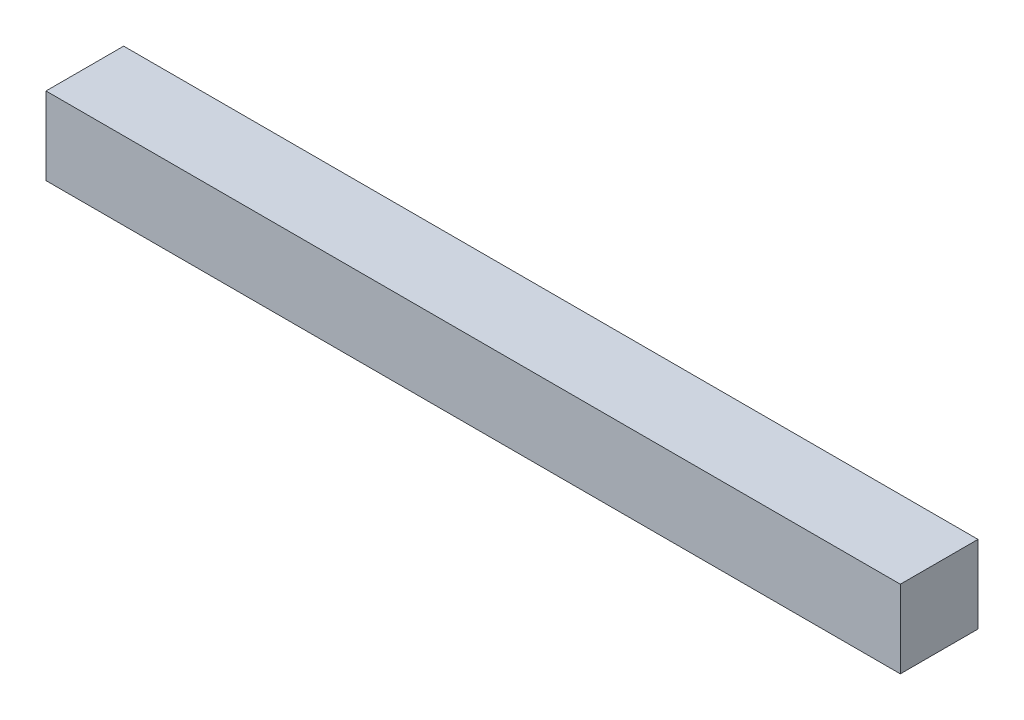
ISO-10303-21;
HEADER;
FILE_DESCRIPTION(('STEP AP214'),'2;1');
FILE_NAME('part.step','',(''),(''),'','','');
FILE_SCHEMA(('AUTOMOTIVE_DESIGN { 1 0 10303 214 1 1 1 1 }'));
ENDSEC;
DATA;
#1=APPLICATION_CONTEXT('core data for automotive mechanical design processes');
#2=APPLICATION_PROTOCOL_DEFINITION('international standard','automotive_design',2000,#1);
#3=PRODUCT_CONTEXT('',#1,'mechanical');
#4=PRODUCT('Part','Part','',(#3));
#5=PRODUCT_RELATED_PRODUCT_CATEGORY('part','',(#4));
#6=PRODUCT_DEFINITION_FORMATION('','',#4);
#7=PRODUCT_DEFINITION_CONTEXT('part definition',#1,'design');
#8=PRODUCT_DEFINITION('design','',#6,#7);
#9=PRODUCT_DEFINITION_SHAPE('','',#8);
#10=(LENGTH_UNIT() NAMED_UNIT(*) SI_UNIT(.MILLI.,.METRE.));
#11=(NAMED_UNIT(*) PLANE_ANGLE_UNIT() SI_UNIT($,.RADIAN.));
#12=(NAMED_UNIT(*) SI_UNIT($,.STERADIAN.) SOLID_ANGLE_UNIT());
#13=UNCERTAINTY_MEASURE_WITH_UNIT(LENGTH_MEASURE(1.E-05),#10,'distance_accuracy_value','');
#14=(GEOMETRIC_REPRESENTATION_CONTEXT(3) GLOBAL_UNCERTAINTY_ASSIGNED_CONTEXT((#13)) GLOBAL_UNIT_ASSIGNED_CONTEXT((#10,
#11,#12)) REPRESENTATION_CONTEXT('',''));
#15=CARTESIAN_POINT('',(0.,0.,0.));
#16=DIRECTION('',(0.,0.,1.));
#17=DIRECTION('',(1.,0.,0.));
#18=AXIS2_PLACEMENT_3D('',#15,#16,#17);
#19=CARTESIAN_POINT('',(165.,-15.,-15.));
#20=DIRECTION('',(0.,0.,1.));
#21=DIRECTION('',(1.,0.,0.));
#22=AXIS2_PLACEMENT_3D('',#19,#20,#21);
#23=PLANE('',#22);
#24=DIRECTION('',(0.,1.,0.));
#25=VECTOR('',#24,1.);
#26=CARTESIAN_POINT('',(-165.,-15.,-15.));
#27=LINE('',#26,#25);
#28=CARTESIAN_POINT('',(-165.,-15.,-15.));
#29=VERTEX_POINT('',#28);
#30=CARTESIAN_POINT('',(-165.,15.,-15.));
#31=VERTEX_POINT('',#30);
#32=EDGE_CURVE('E96',#29,#31,#27,.T.);
#33=ORIENTED_EDGE('',*,*,#32,.T.);
#34=DIRECTION('',(-1.,0.,0.));
#35=VECTOR('',#34,1.);
#36=CARTESIAN_POINT('',(165.,15.,-15.));
#37=LINE('',#36,#35);
#38=CARTESIAN_POINT('',(165.,15.,-15.));
#39=VERTEX_POINT('',#38);
#40=EDGE_CURVE('E11',#39,#31,#37,.T.);
#41=ORIENTED_EDGE('',*,*,#40,.F.);
#42=DIRECTION('',(0.,1.,0.));
#43=VECTOR('',#42,1.);
#44=CARTESIAN_POINT('',(165.,-15.,-15.));
#45=LINE('',#44,#43);
#46=CARTESIAN_POINT('',(165.,-15.,-15.));
#47=VERTEX_POINT('',#46);
#48=EDGE_CURVE('E84',#47,#39,#45,.T.);
#49=ORIENTED_EDGE('',*,*,#48,.F.);
#50=DIRECTION('',(-1.,0.,0.));
#51=VECTOR('',#50,1.);
#52=CARTESIAN_POINT('',(165.,-15.,-15.));
#53=LINE('',#52,#51);
#54=EDGE_CURVE('E92',#47,#29,#53,.T.);
#55=ORIENTED_EDGE('',*,*,#54,.T.);
#56=EDGE_LOOP('',(#33,#41,#49,#55));
#57=FACE_BOUND('',#56,.T.);
#58=ADVANCED_FACE('F33',(#57),#23,.F.);
#59=CARTESIAN_POINT('',(165.,15.,15.));
#60=DIRECTION('',(0.,-1.,0.));
#61=DIRECTION('',(0.,0.,-1.));
#62=AXIS2_PLACEMENT_3D('',#59,#60,#61);
#63=PLANE('',#62);
#64=DIRECTION('',(0.,0.,1.));
#65=VECTOR('',#64,1.);
#66=CARTESIAN_POINT('',(-165.,15.,15.));
#67=LINE('',#66,#65);
#68=CARTESIAN_POINT('',(-165.,15.,15.));
#69=VERTEX_POINT('',#68);
#70=EDGE_CURVE('E88',#31,#69,#67,.T.);
#71=ORIENTED_EDGE('',*,*,#70,.T.);
#72=DIRECTION('',(-1.,0.,0.));
#73=VECTOR('',#72,1.);
#74=CARTESIAN_POINT('',(165.,15.,15.));
#75=LINE('',#74,#73);
#76=CARTESIAN_POINT('',(165.,15.,15.));
#77=VERTEX_POINT('',#76);
#78=EDGE_CURVE('E41',#77,#69,#75,.T.);
#79=ORIENTED_EDGE('',*,*,#78,.F.);
#80=DIRECTION('',(0.,0.,1.));
#81=VECTOR('',#80,1.);
#82=CARTESIAN_POINT('',(165.,15.,15.));
#83=LINE('',#82,#81);
#84=EDGE_CURVE('E79',#39,#77,#83,.T.);
#85=ORIENTED_EDGE('',*,*,#84,.F.);
#86=ORIENTED_EDGE('',*,*,#40,.T.);
#87=EDGE_LOOP('',(#71,#79,#85,#86));
#88=FACE_BOUND('',#87,.T.);
#89=ADVANCED_FACE('F87',(#88),#63,.F.);
#90=CARTESIAN_POINT('',(165.,-15.,15.));
#91=DIRECTION('',(0.,0.,-1.));
#92=DIRECTION('',(-1.,0.,0.));
#93=AXIS2_PLACEMENT_3D('',#90,#91,#92);
#94=PLANE('',#93);
#95=DIRECTION('',(0.,-1.,0.));
#96=VECTOR('',#95,1.);
#97=CARTESIAN_POINT('',(-165.,-15.,15.));
#98=LINE('',#97,#96);
#99=CARTESIAN_POINT('',(-165.,-15.,15.));
#100=VERTEX_POINT('',#99);
#101=EDGE_CURVE('E66',#69,#100,#98,.T.);
#102=ORIENTED_EDGE('',*,*,#101,.T.);
#103=DIRECTION('',(-1.,0.,0.));
#104=VECTOR('',#103,1.);
#105=CARTESIAN_POINT('',(165.,-15.,15.));
#106=LINE('',#105,#104);
#107=CARTESIAN_POINT('',(165.,-15.,15.));
#108=VERTEX_POINT('',#107);
#109=EDGE_CURVE('E89',#108,#100,#106,.T.);
#110=ORIENTED_EDGE('',*,*,#109,.F.);
#111=DIRECTION('',(0.,-1.,0.));
#112=VECTOR('',#111,1.);
#113=CARTESIAN_POINT('',(165.,-15.,15.));
#114=LINE('',#113,#112);
#115=EDGE_CURVE('E82',#77,#108,#114,.T.);
#116=ORIENTED_EDGE('',*,*,#115,.F.);
#117=ORIENTED_EDGE('',*,*,#78,.T.);
#118=EDGE_LOOP('',(#102,#110,#116,#117));
#119=FACE_BOUND('',#118,.T.);
#120=ADVANCED_FACE('F90',(#119),#94,.F.);
#121=CARTESIAN_POINT('',(165.,-15.,15.));
#122=DIRECTION('',(0.,1.,0.));
#123=DIRECTION('',(0.,0.,1.));
#124=AXIS2_PLACEMENT_3D('',#121,#122,#123);
#125=PLANE('',#124);
#126=DIRECTION('',(0.,0.,-1.));
#127=VECTOR('',#126,1.);
#128=CARTESIAN_POINT('',(-165.,-15.,15.));
#129=LINE('',#128,#127);
#130=EDGE_CURVE('E72',#100,#29,#129,.T.);
#131=ORIENTED_EDGE('',*,*,#130,.T.);
#132=ORIENTED_EDGE('',*,*,#54,.F.);
#133=DIRECTION('',(0.,0.,-1.));
#134=VECTOR('',#133,1.);
#135=CARTESIAN_POINT('',(165.,-15.,15.));
#136=LINE('',#135,#134);
#137=EDGE_CURVE('E49',#108,#47,#136,.T.);
#138=ORIENTED_EDGE('',*,*,#137,.F.);
#139=ORIENTED_EDGE('',*,*,#109,.T.);
#140=EDGE_LOOP('',(#131,#132,#138,#139));
#141=FACE_BOUND('',#140,.T.);
#142=ADVANCED_FACE('F103',(#141),#125,.F.);
#143=CARTESIAN_POINT('',(165.,0.,0.));
#144=DIRECTION('',(-1.,0.,0.));
#145=DIRECTION('',(0.,0.,1.));
#146=AXIS2_PLACEMENT_3D('',#143,#144,#145);
#147=PLANE('',#146);
#148=ORIENTED_EDGE('',*,*,#48,.T.);
#149=ORIENTED_EDGE('',*,*,#84,.T.);
#150=ORIENTED_EDGE('',*,*,#115,.T.);
#151=ORIENTED_EDGE('',*,*,#137,.T.);
#152=EDGE_LOOP('',(#148,#149,#150,#151));
#153=FACE_BOUND('',#152,.T.);
#154=ADVANCED_FACE('F80',(#153),#147,.F.);
#155=CARTESIAN_POINT('',(-165.,0.,0.));
#156=DIRECTION('',(-1.,0.,0.));
#157=DIRECTION('',(0.,0.,1.));
#158=AXIS2_PLACEMENT_3D('',#155,#156,#157);
#159=PLANE('',#158);
#160=ORIENTED_EDGE('',*,*,#32,.F.);
#161=ORIENTED_EDGE('',*,*,#130,.F.);
#162=ORIENTED_EDGE('',*,*,#101,.F.);
#163=ORIENTED_EDGE('',*,*,#70,.F.);
#164=EDGE_LOOP('',(#160,#161,#162,#163));
#165=FACE_BOUND('',#164,.T.);
#166=ADVANCED_FACE('F106',(#165),#159,.T.);
#167=CLOSED_SHELL('',(#58,#89,#120,#142,#154,#166));
#168=MANIFOLD_SOLID_BREP('B2',#167);
#169=ADVANCED_BREP_SHAPE_REPRESENTATION('',(#18,#168),#14);
#170=SHAPE_DEFINITION_REPRESENTATION(#9,#169);
ENDSEC;
END-ISO-10303-21;
